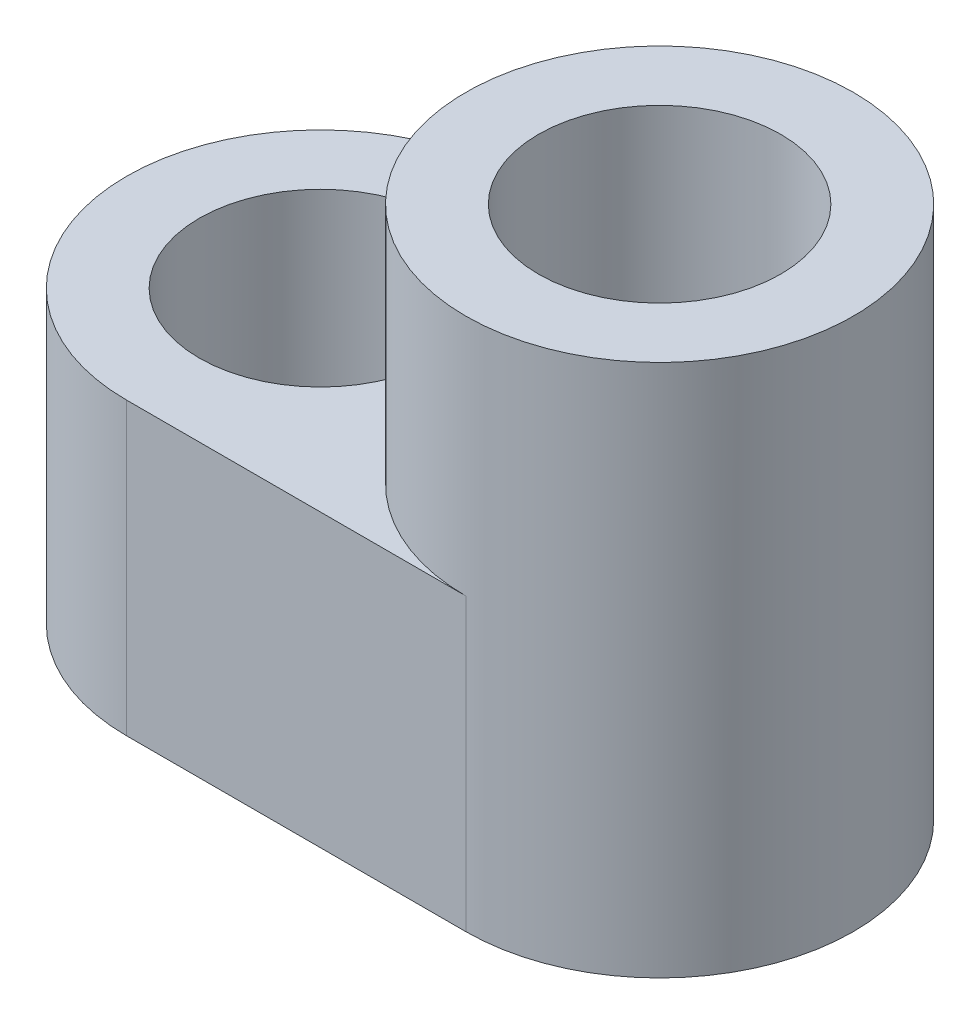
ISO-10303-21;
HEADER;
FILE_DESCRIPTION(('STEP AP214'),'2;1');
FILE_NAME('part.step','',(''),(''),'','','');
FILE_SCHEMA(('AUTOMOTIVE_DESIGN { 1 0 10303 214 1 1 1 1 }'));
ENDSEC;
DATA;
#1=APPLICATION_CONTEXT('core data for automotive mechanical design processes');
#2=APPLICATION_PROTOCOL_DEFINITION('international standard','automotive_design',2000,#1);
#3=PRODUCT_CONTEXT('',#1,'mechanical');
#4=PRODUCT('Part','Part','',(#3));
#5=PRODUCT_RELATED_PRODUCT_CATEGORY('part','',(#4));
#6=PRODUCT_DEFINITION_FORMATION('','',#4);
#7=PRODUCT_DEFINITION_CONTEXT('part definition',#1,'design');
#8=PRODUCT_DEFINITION('design','',#6,#7);
#9=PRODUCT_DEFINITION_SHAPE('','',#8);
#10=(LENGTH_UNIT() NAMED_UNIT(*) SI_UNIT(.MILLI.,.METRE.));
#11=(NAMED_UNIT(*) PLANE_ANGLE_UNIT() SI_UNIT($,.RADIAN.));
#12=(NAMED_UNIT(*) SI_UNIT($,.STERADIAN.) SOLID_ANGLE_UNIT());
#13=UNCERTAINTY_MEASURE_WITH_UNIT(LENGTH_MEASURE(1.E-05),#10,'distance_accuracy_value','');
#14=(GEOMETRIC_REPRESENTATION_CONTEXT(3) GLOBAL_UNCERTAINTY_ASSIGNED_CONTEXT((#13)) GLOBAL_UNIT_ASSIGNED_CONTEXT((#10,
#11,#12)) REPRESENTATION_CONTEXT('',''));
#15=CARTESIAN_POINT('',(0.,0.,0.));
#16=DIRECTION('',(0.,0.,1.));
#17=DIRECTION('',(1.,0.,0.));
#18=AXIS2_PLACEMENT_3D('',#15,#16,#17);
#19=CARTESIAN_POINT('',(0.,6.,0.));
#20=DIRECTION('',(0.,-1.,0.));
#21=DIRECTION('',(0.,0.,-1.));
#22=AXIS2_PLACEMENT_3D('',#19,#20,#21);
#23=PLANE('',#22);
#24=CARTESIAN_POINT('',(-3.5,6.,0.));
#25=DIRECTION('',(0.,1.,0.));
#26=DIRECTION('',(0.,0.,1.));
#27=AXIS2_PLACEMENT_3D('',#24,#25,#26);
#28=CIRCLE('',#27,2.5);
#29=CARTESIAN_POINT('',(-3.5,6.,2.50000000000001));
#30=VERTEX_POINT('',#29);
#31=EDGE_CURVE('E138',#30,#30,#28,.T.);
#32=ORIENTED_EDGE('',*,*,#31,.F.);
#33=EDGE_LOOP('',(#32));
#34=FACE_BOUND('',#33,.T.);
#35=CARTESIAN_POINT('',(3.5,6.,0.));
#36=DIRECTION('',(0.,1.,0.));
#37=DIRECTION('',(0.,0.,1.));
#38=AXIS2_PLACEMENT_3D('',#35,#36,#37);
#39=CIRCLE('',#38,4.);
#40=CARTESIAN_POINT('',(3.5,6.,-4.));
#41=VERTEX_POINT('',#40);
#42=CARTESIAN_POINT('',(3.5,6.,4.00000000000002));
#43=VERTEX_POINT('',#42);
#44=EDGE_CURVE('E11',#41,#43,#39,.T.);
#45=ORIENTED_EDGE('',*,*,#44,.F.);
#46=DIRECTION('',(-1.,0.,0.));
#47=VECTOR('',#46,1.);
#48=CARTESIAN_POINT('',(-7.5,6.,-4.));
#49=LINE('',#48,#47);
#50=CARTESIAN_POINT('',(-3.5,6.,-4.));
#51=VERTEX_POINT('',#50);
#52=EDGE_CURVE('E90',#41,#51,#49,.T.);
#53=ORIENTED_EDGE('',*,*,#52,.T.);
#54=CARTESIAN_POINT('',(-3.5,6.,0.));
#55=DIRECTION('',(0.,-1.,0.));
#56=DIRECTION('',(0.,0.,-1.));
#57=AXIS2_PLACEMENT_3D('',#54,#55,#56);
#58=CIRCLE('',#57,4.);
#59=CARTESIAN_POINT('',(-7.5,6.,0.));
#60=VERTEX_POINT('',#59);
#61=EDGE_CURVE('E56',#51,#60,#58,.F.);
#62=ORIENTED_EDGE('',*,*,#61,.T.);
#63=CARTESIAN_POINT('',(-3.5,6.,0.));
#64=DIRECTION('',(0.,-1.,0.));
#65=DIRECTION('',(0.,0.,-1.));
#66=AXIS2_PLACEMENT_3D('',#63,#64,#65);
#67=CIRCLE('',#66,4.);
#68=CARTESIAN_POINT('',(-3.5,6.,4.));
#69=VERTEX_POINT('',#68);
#70=EDGE_CURVE('E51',#60,#69,#67,.F.);
#71=ORIENTED_EDGE('',*,*,#70,.T.);
#72=DIRECTION('',(1.,0.,0.));
#73=VECTOR('',#72,1.);
#74=CARTESIAN_POINT('',(-7.5,6.,4.));
#75=LINE('',#74,#73);
#76=EDGE_CURVE('E84',#69,#43,#75,.T.);
#77=ORIENTED_EDGE('',*,*,#76,.T.);
#78=EDGE_LOOP('',(#45,#53,#62,#71,#77));
#79=FACE_BOUND('',#78,.T.);
#80=ADVANCED_FACE('F34',(#34,#79),#23,.F.);
#81=CARTESIAN_POINT('',(0.,0.,0.));
#82=DIRECTION('',(0.,-1.,0.));
#83=DIRECTION('',(0.,0.,-1.));
#84=AXIS2_PLACEMENT_3D('',#81,#82,#83);
#85=PLANE('',#84);
#86=CARTESIAN_POINT('',(-3.5,0.,0.));
#87=DIRECTION('',(0.,1.,0.));
#88=DIRECTION('',(0.,0.,1.));
#89=AXIS2_PLACEMENT_3D('',#86,#87,#88);
#90=CIRCLE('',#89,2.5);
#91=CARTESIAN_POINT('',(-3.5,0.,2.50000000000001));
#92=VERTEX_POINT('',#91);
#93=EDGE_CURVE('E137',#92,#92,#90,.T.);
#94=ORIENTED_EDGE('',*,*,#93,.T.);
#95=EDGE_LOOP('',(#94));
#96=FACE_BOUND('',#95,.T.);
#97=DIRECTION('',(-1.,0.,0.));
#98=VECTOR('',#97,1.);
#99=CARTESIAN_POINT('',(-7.5,0.,-4.));
#100=LINE('',#99,#98);
#101=CARTESIAN_POINT('',(3.5,0.,-4.));
#102=VERTEX_POINT('',#101);
#103=CARTESIAN_POINT('',(-3.5,0.,-4.));
#104=VERTEX_POINT('',#103);
#105=EDGE_CURVE('E141',#102,#104,#100,.T.);
#106=ORIENTED_EDGE('',*,*,#105,.F.);
#107=CARTESIAN_POINT('',(3.5,0.,0.));
#108=DIRECTION('',(0.,-1.,0.));
#109=DIRECTION('',(0.,0.,-1.));
#110=AXIS2_PLACEMENT_3D('',#107,#108,#109);
#111=CIRCLE('',#110,4.);
#112=CARTESIAN_POINT('',(7.5,0.,0.));
#113=VERTEX_POINT('',#112);
#114=EDGE_CURVE('E106',#102,#113,#111,.T.);
#115=ORIENTED_EDGE('',*,*,#114,.T.);
#116=CARTESIAN_POINT('',(3.5,0.,0.));
#117=DIRECTION('',(0.,-1.,0.));
#118=DIRECTION('',(0.,0.,-1.));
#119=AXIS2_PLACEMENT_3D('',#116,#117,#118);
#120=CIRCLE('',#119,4.);
#121=CARTESIAN_POINT('',(3.5,0.,4.));
#122=VERTEX_POINT('',#121);
#123=EDGE_CURVE('E114',#113,#122,#120,.T.);
#124=ORIENTED_EDGE('',*,*,#123,.T.);
#125=DIRECTION('',(1.,0.,0.));
#126=VECTOR('',#125,1.);
#127=CARTESIAN_POINT('',(-7.5,0.,4.));
#128=LINE('',#127,#126);
#129=CARTESIAN_POINT('',(-3.5,0.,4.));
#130=VERTEX_POINT('',#129);
#131=EDGE_CURVE('E96',#130,#122,#128,.T.);
#132=ORIENTED_EDGE('',*,*,#131,.F.);
#133=CARTESIAN_POINT('',(-3.5,0.,0.));
#134=DIRECTION('',(0.,-1.,0.));
#135=DIRECTION('',(0.,0.,-1.));
#136=AXIS2_PLACEMENT_3D('',#133,#134,#135);
#137=CIRCLE('',#136,4.);
#138=CARTESIAN_POINT('',(-7.5,0.,0.));
#139=VERTEX_POINT('',#138);
#140=EDGE_CURVE('E89',#130,#139,#137,.T.);
#141=ORIENTED_EDGE('',*,*,#140,.T.);
#142=CARTESIAN_POINT('',(-3.5,0.,0.));
#143=DIRECTION('',(0.,-1.,0.));
#144=DIRECTION('',(0.,0.,-1.));
#145=AXIS2_PLACEMENT_3D('',#142,#143,#144);
#146=CIRCLE('',#145,4.);
#147=EDGE_CURVE('E147',#139,#104,#146,.T.);
#148=ORIENTED_EDGE('',*,*,#147,.T.);
#149=EDGE_LOOP('',(#106,#115,#124,#132,#141,#148));
#150=FACE_BOUND('',#149,.T.);
#151=CARTESIAN_POINT('',(3.5,0.,0.));
#152=DIRECTION('',(0.,1.,0.));
#153=DIRECTION('',(0.,0.,1.));
#154=AXIS2_PLACEMENT_3D('',#151,#152,#153);
#155=CIRCLE('',#154,2.5);
#156=CARTESIAN_POINT('',(3.5,0.,2.50000000000002));
#157=VERTEX_POINT('',#156);
#158=EDGE_CURVE('E127',#157,#157,#155,.T.);
#159=ORIENTED_EDGE('',*,*,#158,.T.);
#160=EDGE_LOOP('',(#159));
#161=FACE_BOUND('',#160,.T.);
#162=ADVANCED_FACE('F167',(#96,#150,#161),#85,.T.);
#163=CARTESIAN_POINT('',(-7.5,6.,-4.));
#164=DIRECTION('',(0.,0.,1.));
#165=DIRECTION('',(1.,0.,0.));
#166=AXIS2_PLACEMENT_3D('',#163,#164,#165);
#167=PLANE('',#166);
#168=ORIENTED_EDGE('',*,*,#105,.T.);
#169=DIRECTION('',(0.,-1.,0.));
#170=VECTOR('',#169,1.);
#171=CARTESIAN_POINT('',(-3.5,6.,-4.));
#172=LINE('',#171,#170);
#173=EDGE_CURVE('E110',#104,#51,#172,.F.);
#174=ORIENTED_EDGE('',*,*,#173,.T.);
#175=ORIENTED_EDGE('',*,*,#52,.F.);
#176=DIRECTION('',(0.,-1.,0.));
#177=VECTOR('',#176,1.);
#178=CARTESIAN_POINT('',(3.5,6.,-4.));
#179=LINE('',#178,#177);
#180=EDGE_CURVE('E104',#41,#102,#179,.T.);
#181=ORIENTED_EDGE('',*,*,#180,.T.);
#182=EDGE_LOOP('',(#168,#174,#175,#181));
#183=FACE_BOUND('',#182,.T.);
#184=ADVANCED_FACE('F157',(#183),#167,.F.);
#185=CARTESIAN_POINT('',(-7.5,6.,4.));
#186=DIRECTION('',(0.,0.,-1.));
#187=DIRECTION('',(-1.,0.,0.));
#188=AXIS2_PLACEMENT_3D('',#185,#186,#187);
#189=PLANE('',#188);
#190=ORIENTED_EDGE('',*,*,#131,.T.);
#191=DIRECTION('',(0.,-1.,0.));
#192=VECTOR('',#191,1.);
#193=CARTESIAN_POINT('',(3.5,6.,4.));
#194=LINE('',#193,#192);
#195=EDGE_CURVE('E43',#122,#43,#194,.F.);
#196=ORIENTED_EDGE('',*,*,#195,.T.);
#197=ORIENTED_EDGE('',*,*,#76,.F.);
#198=DIRECTION('',(0.,-1.,0.));
#199=VECTOR('',#198,1.);
#200=CARTESIAN_POINT('',(-3.5,6.,4.));
#201=LINE('',#200,#199);
#202=EDGE_CURVE('E99',#69,#130,#201,.T.);
#203=ORIENTED_EDGE('',*,*,#202,.T.);
#204=EDGE_LOOP('',(#190,#196,#197,#203));
#205=FACE_BOUND('',#204,.T.);
#206=ADVANCED_FACE('F94',(#205),#189,.F.);
#207=CARTESIAN_POINT('',(-3.5,6.,0.));
#208=DIRECTION('',(0.,-1.,0.));
#209=DIRECTION('',(0.,0.,-1.));
#210=AXIS2_PLACEMENT_3D('',#207,#208,#209);
#211=CYLINDRICAL_SURFACE('',#210,2.5);
#212=ORIENTED_EDGE('',*,*,#31,.T.);
#213=EDGE_LOOP('',(#212));
#214=FACE_BOUND('',#213,.T.);
#215=ORIENTED_EDGE('',*,*,#93,.F.);
#216=EDGE_LOOP('',(#215));
#217=FACE_BOUND('',#216,.T.);
#218=ADVANCED_FACE('F177',(#214,#217),#211,.F.);
#219=CARTESIAN_POINT('',(3.5,6.,0.));
#220=DIRECTION('',(0.,-1.,0.));
#221=DIRECTION('',(0.,0.,-1.));
#222=AXIS2_PLACEMENT_3D('',#219,#220,#221);
#223=CYLINDRICAL_SURFACE('',#222,2.5);
#224=ORIENTED_EDGE('',*,*,#158,.F.);
#225=EDGE_LOOP('',(#224));
#226=FACE_BOUND('',#225,.T.);
#227=CARTESIAN_POINT('',(3.49999999999999,11.,0.));
#228=DIRECTION('',(0.,1.,0.));
#229=DIRECTION('',(0.,0.,1.));
#230=AXIS2_PLACEMENT_3D('',#227,#228,#229);
#231=CIRCLE('',#230,2.49999999999999);
#232=CARTESIAN_POINT('',(3.49999999999999,11.,2.5));
#233=VERTEX_POINT('',#232);
#234=EDGE_CURVE('E38',#233,#233,#231,.T.);
#235=ORIENTED_EDGE('',*,*,#234,.T.);
#236=EDGE_LOOP('',(#235));
#237=FACE_BOUND('',#236,.T.);
#238=ADVANCED_FACE('F174',(#226,#237),#223,.F.);
#239=CARTESIAN_POINT('',(-3.5,6.,0.));
#240=DIRECTION('',(0.,-1.,0.));
#241=DIRECTION('',(0.,0.,-1.));
#242=AXIS2_PLACEMENT_3D('',#239,#240,#241);
#243=CYLINDRICAL_SURFACE('',#242,4.);
#244=ORIENTED_EDGE('',*,*,#202,.F.);
#245=ORIENTED_EDGE('',*,*,#70,.F.);
#246=DIRECTION('',(0.,-1.,0.));
#247=VECTOR('',#246,1.);
#248=CARTESIAN_POINT('',(-7.5,6.,0.));
#249=LINE('',#248,#247);
#250=EDGE_CURVE('E123',#139,#60,#249,.F.);
#251=ORIENTED_EDGE('',*,*,#250,.F.);
#252=ORIENTED_EDGE('',*,*,#140,.F.);
#253=EDGE_LOOP('',(#244,#245,#251,#252));
#254=FACE_BOUND('',#253,.T.);
#255=ADVANCED_FACE('F165',(#254),#243,.T.);
#256=CARTESIAN_POINT('',(-3.5,6.,0.));
#257=DIRECTION('',(0.,-1.,0.));
#258=DIRECTION('',(0.,0.,-1.));
#259=AXIS2_PLACEMENT_3D('',#256,#257,#258);
#260=CYLINDRICAL_SURFACE('',#259,4.);
#261=ORIENTED_EDGE('',*,*,#61,.F.);
#262=ORIENTED_EDGE('',*,*,#173,.F.);
#263=ORIENTED_EDGE('',*,*,#147,.F.);
#264=ORIENTED_EDGE('',*,*,#250,.T.);
#265=EDGE_LOOP('',(#261,#262,#263,#264));
#266=FACE_BOUND('',#265,.T.);
#267=ADVANCED_FACE('F161',(#266),#260,.T.);
#268=CARTESIAN_POINT('',(3.5,6.,0.));
#269=DIRECTION('',(0.,-1.,0.));
#270=DIRECTION('',(0.,0.,-1.));
#271=AXIS2_PLACEMENT_3D('',#268,#269,#270);
#272=CYLINDRICAL_SURFACE('',#271,4.);
#273=DIRECTION('',(0.,-1.,0.));
#274=VECTOR('',#273,1.);
#275=CARTESIAN_POINT('',(7.5,6.,0.));
#276=LINE('',#275,#274);
#277=CARTESIAN_POINT('',(7.5,6.,0.));
#278=VERTEX_POINT('',#277);
#279=EDGE_CURVE('E122',#278,#113,#276,.T.);
#280=ORIENTED_EDGE('',*,*,#279,.F.);
#281=ORIENTED_EDGE('',*,*,#279,.T.);
#282=ORIENTED_EDGE('',*,*,#114,.F.);
#283=ORIENTED_EDGE('',*,*,#180,.F.);
#284=ORIENTED_EDGE('',*,*,#44,.T.);
#285=ORIENTED_EDGE('',*,*,#195,.F.);
#286=ORIENTED_EDGE('',*,*,#123,.F.);
#287=EDGE_LOOP('',(#280,#281,#282,#283,#284,#285,#286));
#288=FACE_BOUND('',#287,.T.);
#289=CARTESIAN_POINT('',(3.5,11.,0.));
#290=DIRECTION('',(0.,1.,0.));
#291=DIRECTION('',(0.,0.,1.));
#292=AXIS2_PLACEMENT_3D('',#289,#290,#291);
#293=CIRCLE('',#292,4.);
#294=CARTESIAN_POINT('',(3.5,11.,4.00000000000002));
#295=VERTEX_POINT('',#294);
#296=EDGE_CURVE('E124',#295,#295,#293,.T.);
#297=ORIENTED_EDGE('',*,*,#296,.F.);
#298=EDGE_LOOP('',(#297));
#299=FACE_BOUND('',#298,.T.);
#300=ADVANCED_FACE('F36',(#288,#299),#272,.T.);
#301=CARTESIAN_POINT('',(3.5,11.,0.));
#302=DIRECTION('',(0.,1.,0.));
#303=DIRECTION('',(0.,0.,1.));
#304=AXIS2_PLACEMENT_3D('',#301,#302,#303);
#305=PLANE('',#304);
#306=ORIENTED_EDGE('',*,*,#234,.F.);
#307=EDGE_LOOP('',(#306));
#308=FACE_BOUND('',#307,.T.);
#309=ORIENTED_EDGE('',*,*,#296,.T.);
#310=EDGE_LOOP('',(#309));
#311=FACE_BOUND('',#310,.T.);
#312=ADVANCED_FACE('F181',(#308,#311),#305,.T.);
#313=CLOSED_SHELL('',(#80,#162,#184,#206,#218,#238,#255,#267,#300,#312));
#314=MANIFOLD_SOLID_BREP('B2',#313);
#315=ADVANCED_BREP_SHAPE_REPRESENTATION('',(#18,#314),#14);
#316=SHAPE_DEFINITION_REPRESENTATION(#9,#315);
ENDSEC;
END-ISO-10303-21;
